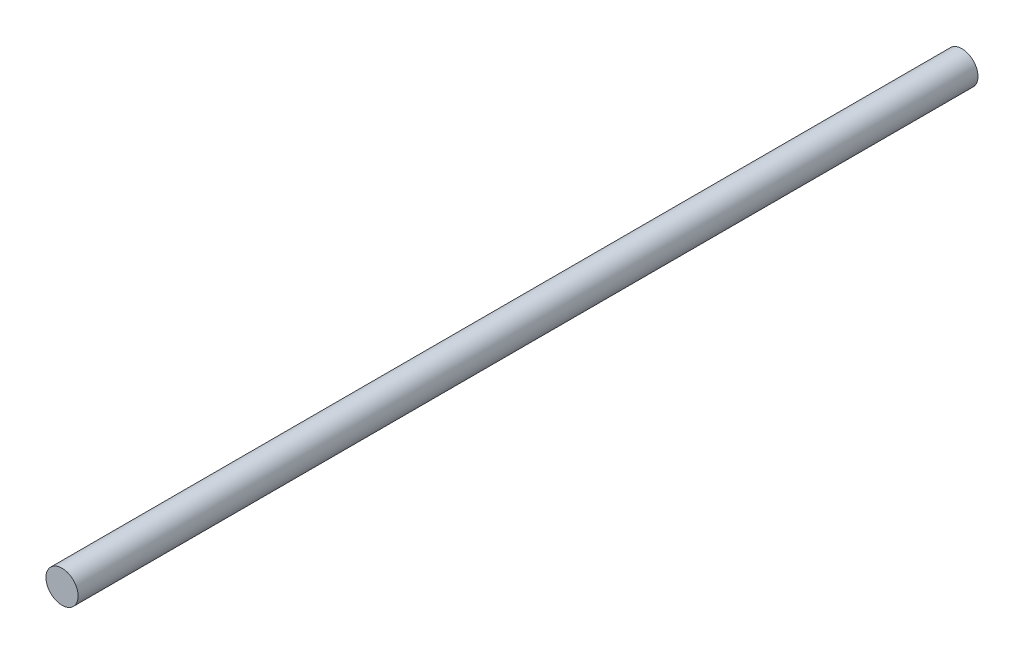
ISO-10303-21;
HEADER;
FILE_DESCRIPTION(('STEP AP214'),'2;1');
FILE_NAME('part.step','',(''),(''),'','','');
FILE_SCHEMA(('AUTOMOTIVE_DESIGN { 1 0 10303 214 1 1 1 1 }'));
ENDSEC;
DATA;
#1=APPLICATION_CONTEXT('core data for automotive mechanical design processes');
#2=APPLICATION_PROTOCOL_DEFINITION('international standard','automotive_design',2000,#1);
#3=PRODUCT_CONTEXT('',#1,'mechanical');
#4=PRODUCT('Part','Part','',(#3));
#5=PRODUCT_RELATED_PRODUCT_CATEGORY('part','',(#4));
#6=PRODUCT_DEFINITION_FORMATION('','',#4);
#7=PRODUCT_DEFINITION_CONTEXT('part definition',#1,'design');
#8=PRODUCT_DEFINITION('design','',#6,#7);
#9=PRODUCT_DEFINITION_SHAPE('','',#8);
#10=(LENGTH_UNIT() NAMED_UNIT(*) SI_UNIT(.MILLI.,.METRE.));
#11=(NAMED_UNIT(*) PLANE_ANGLE_UNIT() SI_UNIT($,.RADIAN.));
#12=(NAMED_UNIT(*) SI_UNIT($,.STERADIAN.) SOLID_ANGLE_UNIT());
#13=UNCERTAINTY_MEASURE_WITH_UNIT(LENGTH_MEASURE(1.E-05),#10,'distance_accuracy_value','');
#14=(GEOMETRIC_REPRESENTATION_CONTEXT(3) GLOBAL_UNCERTAINTY_ASSIGNED_CONTEXT((#13)) GLOBAL_UNIT_ASSIGNED_CONTEXT((#10,
#11,#12)) REPRESENTATION_CONTEXT('',''));
#15=CARTESIAN_POINT('',(0.,0.,0.));
#16=DIRECTION('',(0.,0.,1.));
#17=DIRECTION('',(1.,0.,0.));
#18=AXIS2_PLACEMENT_3D('',#15,#16,#17);
#19=CARTESIAN_POINT('',(0.,0.,840.));
#20=DIRECTION('',(0.,0.,-1.));
#21=DIRECTION('',(-1.,0.,0.));
#22=AXIS2_PLACEMENT_3D('',#19,#20,#21);
#23=CYLINDRICAL_SURFACE('',#22,15.);
#24=CARTESIAN_POINT('',(0.,0.,840.));
#25=DIRECTION('',(0.,0.,1.));
#26=DIRECTION('',(1.,0.,0.));
#27=AXIS2_PLACEMENT_3D('',#24,#25,#26);
#28=CIRCLE('',#27,15.);
#29=CARTESIAN_POINT('',(15.,0.,840.));
#30=VERTEX_POINT('',#29);
#31=EDGE_CURVE('E10',#30,#30,#28,.T.);
#32=ORIENTED_EDGE('',*,*,#31,.F.);
#33=EDGE_LOOP('',(#32));
#34=FACE_BOUND('',#33,.T.);
#35=CARTESIAN_POINT('',(0.,0.,0.));
#36=DIRECTION('',(0.,0.,1.));
#37=DIRECTION('',(1.,0.,0.));
#38=AXIS2_PLACEMENT_3D('',#35,#36,#37);
#39=CIRCLE('',#38,15.);
#40=CARTESIAN_POINT('',(15.,0.,0.));
#41=VERTEX_POINT('',#40);
#42=EDGE_CURVE('E40',#41,#41,#39,.T.);
#43=ORIENTED_EDGE('',*,*,#42,.T.);
#44=EDGE_LOOP('',(#43));
#45=FACE_BOUND('',#44,.T.);
#46=ADVANCED_FACE('F37',(#34,#45),#23,.T.);
#47=CARTESIAN_POINT('',(0.,0.,840.));
#48=DIRECTION('',(0.,0.,1.));
#49=DIRECTION('',(1.,0.,0.));
#50=AXIS2_PLACEMENT_3D('',#47,#48,#49);
#51=PLANE('',#50);
#52=ORIENTED_EDGE('',*,*,#31,.T.);
#53=EDGE_LOOP('',(#52));
#54=FACE_BOUND('',#53,.T.);
#55=ADVANCED_FACE('F54',(#54),#51,.T.);
#56=CARTESIAN_POINT('',(0.,0.,0.));
#57=DIRECTION('',(0.,0.,1.));
#58=DIRECTION('',(1.,0.,0.));
#59=AXIS2_PLACEMENT_3D('',#56,#57,#58);
#60=PLANE('',#59);
#61=ORIENTED_EDGE('',*,*,#42,.F.);
#62=EDGE_LOOP('',(#61));
#63=FACE_BOUND('',#62,.T.);
#64=ADVANCED_FACE('F52',(#63),#60,.F.);
#65=CLOSED_SHELL('',(#46,#55,#64));
#66=MANIFOLD_SOLID_BREP('B2',#65);
#67=ADVANCED_BREP_SHAPE_REPRESENTATION('',(#18,#66),#14);
#68=SHAPE_DEFINITION_REPRESENTATION(#9,#67);
ENDSEC;
END-ISO-10303-21;
